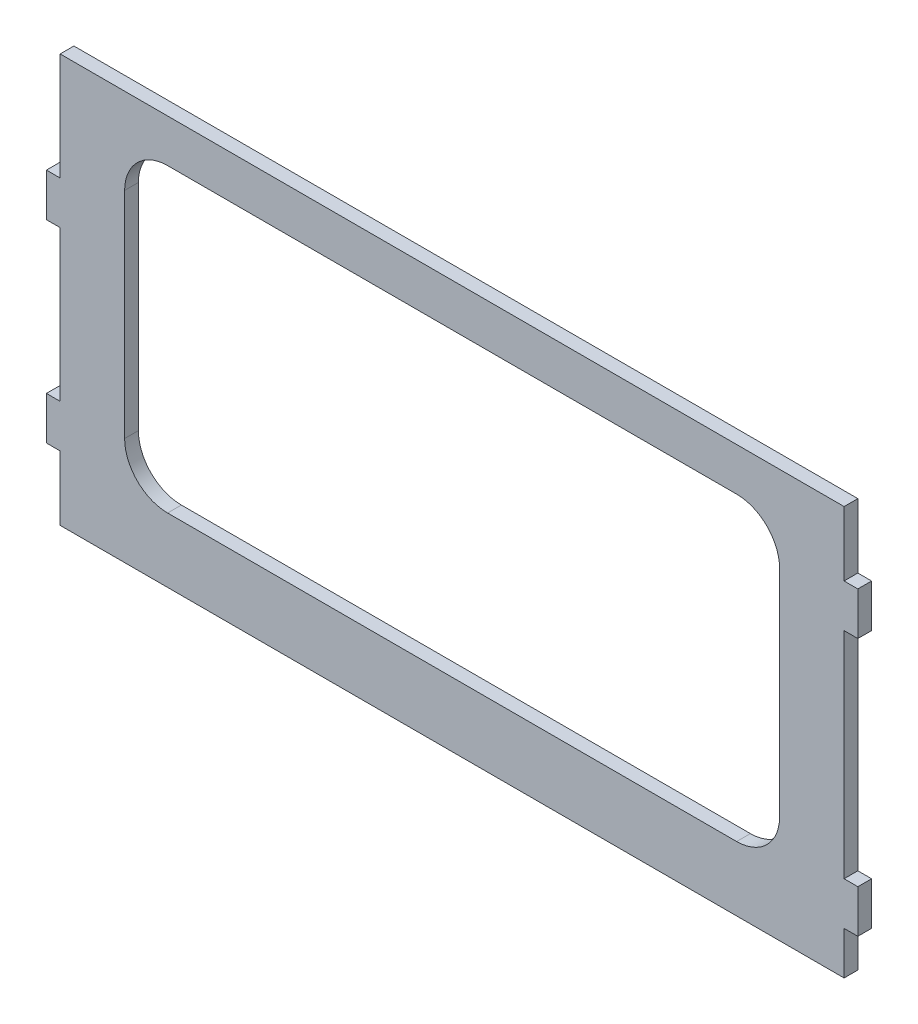
ISO-10303-21;
HEADER;
FILE_DESCRIPTION(('STEP AP214'),'2;1');
FILE_NAME('part.step','',(''),(''),'','','');
FILE_SCHEMA(('AUTOMOTIVE_DESIGN { 1 0 10303 214 1 1 1 1 }'));
ENDSEC;
DATA;
#1=APPLICATION_CONTEXT('core data for automotive mechanical design processes');
#2=APPLICATION_PROTOCOL_DEFINITION('international standard','automotive_design',2000,#1);
#3=PRODUCT_CONTEXT('',#1,'mechanical');
#4=PRODUCT('Part','Part','',(#3));
#5=PRODUCT_RELATED_PRODUCT_CATEGORY('part','',(#4));
#6=PRODUCT_DEFINITION_FORMATION('','',#4);
#7=PRODUCT_DEFINITION_CONTEXT('part definition',#1,'design');
#8=PRODUCT_DEFINITION('design','',#6,#7);
#9=PRODUCT_DEFINITION_SHAPE('','',#8);
#10=(LENGTH_UNIT() NAMED_UNIT(*) SI_UNIT(.MILLI.,.METRE.));
#11=(NAMED_UNIT(*) PLANE_ANGLE_UNIT() SI_UNIT($,.RADIAN.));
#12=(NAMED_UNIT(*) SI_UNIT($,.STERADIAN.) SOLID_ANGLE_UNIT());
#13=UNCERTAINTY_MEASURE_WITH_UNIT(LENGTH_MEASURE(1.E-05),#10,'distance_accuracy_value','');
#14=(GEOMETRIC_REPRESENTATION_CONTEXT(3) GLOBAL_UNCERTAINTY_ASSIGNED_CONTEXT((#13)) GLOBAL_UNIT_ASSIGNED_CONTEXT((#10,
#11,#12)) REPRESENTATION_CONTEXT('',''));
#15=CARTESIAN_POINT('',(0.,0.,0.));
#16=DIRECTION('',(0.,0.,1.));
#17=DIRECTION('',(1.,0.,0.));
#18=AXIS2_PLACEMENT_3D('',#15,#16,#17);
#19=CARTESIAN_POINT('',(125.750548905286,0.,4.064));
#20=DIRECTION('',(-1.,0.,0.));
#21=DIRECTION('',(0.,0.,1.));
#22=AXIS2_PLACEMENT_3D('',#19,#20,#21);
#23=PLANE('',#22);
#24=DIRECTION('',(0.,1.,0.));
#25=VECTOR('',#24,1.);
#26=CARTESIAN_POINT('',(125.750548905286,0.,0.));
#27=LINE('',#26,#25);
#28=CARTESIAN_POINT('',(125.750548905286,-19.0499999999999,0.));
#29=VERTEX_POINT('',#28);
#30=CARTESIAN_POINT('',(125.750548905286,0.,0.));
#31=VERTEX_POINT('',#30);
#32=EDGE_CURVE('E279',#29,#31,#27,.T.);
#33=ORIENTED_EDGE('',*,*,#32,.T.);
#34=DIRECTION('',(0.,0.,-1.));
#35=VECTOR('',#34,1.);
#36=CARTESIAN_POINT('',(125.750548905286,0.,4.064));
#37=LINE('',#36,#35);
#38=CARTESIAN_POINT('',(125.750548905286,0.,4.064));
#39=VERTEX_POINT('',#38);
#40=EDGE_CURVE('E11',#39,#31,#37,.T.);
#41=ORIENTED_EDGE('',*,*,#40,.F.);
#42=DIRECTION('',(0.,1.,0.));
#43=VECTOR('',#42,1.);
#44=CARTESIAN_POINT('',(125.750548905286,0.,4.064));
#45=LINE('',#44,#43);
#46=CARTESIAN_POINT('',(125.750548905286,-19.0499999999999,4.064));
#47=VERTEX_POINT('',#46);
#48=EDGE_CURVE('E291',#47,#39,#45,.T.);
#49=ORIENTED_EDGE('',*,*,#48,.F.);
#50=DIRECTION('',(0.,0.,-1.));
#51=VECTOR('',#50,1.);
#52=CARTESIAN_POINT('',(125.750548905286,-19.0499999999999,4.064));
#53=LINE('',#52,#51);
#54=EDGE_CURVE('E333',#47,#29,#53,.T.);
#55=ORIENTED_EDGE('',*,*,#54,.T.);
#56=EDGE_LOOP('',(#33,#41,#49,#55));
#57=FACE_BOUND('',#56,.T.);
#58=ADVANCED_FACE('F37',(#57),#23,.F.);
#59=CARTESIAN_POINT('',(125.750548905286,0.,4.064));
#60=DIRECTION('',(0.,-1.,0.));
#61=DIRECTION('',(1.,0.,0.));
#62=AXIS2_PLACEMENT_3D('',#59,#60,#61);
#63=PLANE('',#62);
#64=DIRECTION('',(-1.,0.,0.));
#65=VECTOR('',#64,1.);
#66=CARTESIAN_POINT('',(125.750548905286,0.,0.));
#67=LINE('',#66,#65);
#68=CARTESIAN_POINT('',(-105.897451094714,0.,0.));
#69=VERTEX_POINT('',#68);
#70=EDGE_CURVE('E336',#31,#69,#67,.T.);
#71=ORIENTED_EDGE('',*,*,#70,.T.);
#72=DIRECTION('',(0.,0.,-1.));
#73=VECTOR('',#72,1.);
#74=CARTESIAN_POINT('',(-105.897451094714,0.,4.064));
#75=LINE('',#74,#73);
#76=CARTESIAN_POINT('',(-105.897451094714,0.,4.064));
#77=VERTEX_POINT('',#76);
#78=EDGE_CURVE('E44',#77,#69,#75,.T.);
#79=ORIENTED_EDGE('',*,*,#78,.F.);
#80=DIRECTION('',(-1.,0.,0.));
#81=VECTOR('',#80,1.);
#82=CARTESIAN_POINT('',(125.750548905286,0.,4.064));
#83=LINE('',#82,#81);
#84=EDGE_CURVE('E294',#39,#77,#83,.T.);
#85=ORIENTED_EDGE('',*,*,#84,.F.);
#86=ORIENTED_EDGE('',*,*,#40,.T.);
#87=EDGE_LOOP('',(#71,#79,#85,#86));
#88=FACE_BOUND('',#87,.T.);
#89=ADVANCED_FACE('F454',(#88),#63,.F.);
#90=CARTESIAN_POINT('',(-105.897451094714,0.,4.064));
#91=DIRECTION('',(1.,0.,0.));
#92=DIRECTION('',(0.,0.,-1.));
#93=AXIS2_PLACEMENT_3D('',#90,#91,#92);
#94=PLANE('',#93);
#95=DIRECTION('',(0.,-1.,0.));
#96=VECTOR('',#95,1.);
#97=CARTESIAN_POINT('',(-105.897451094714,0.,0.));
#98=LINE('',#97,#96);
#99=CARTESIAN_POINT('',(-105.897451094714,-31.75,0.));
#100=VERTEX_POINT('',#99);
#101=EDGE_CURVE('E338',#69,#100,#98,.T.);
#102=ORIENTED_EDGE('',*,*,#101,.T.);
#103=DIRECTION('',(0.,0.,-1.));
#104=VECTOR('',#103,1.);
#105=CARTESIAN_POINT('',(-105.897451094714,-31.75,4.064));
#106=LINE('',#105,#104);
#107=CARTESIAN_POINT('',(-105.897451094714,-31.75,4.064));
#108=VERTEX_POINT('',#107);
#109=EDGE_CURVE('E426',#108,#100,#106,.T.);
#110=ORIENTED_EDGE('',*,*,#109,.F.);
#111=DIRECTION('',(0.,-1.,0.));
#112=VECTOR('',#111,1.);
#113=CARTESIAN_POINT('',(-105.897451094714,0.,4.064));
#114=LINE('',#113,#112);
#115=EDGE_CURVE('E297',#77,#108,#114,.T.);
#116=ORIENTED_EDGE('',*,*,#115,.F.);
#117=ORIENTED_EDGE('',*,*,#78,.T.);
#118=EDGE_LOOP('',(#102,#110,#116,#117));
#119=FACE_BOUND('',#118,.T.);
#120=ADVANCED_FACE('F433',(#119),#94,.F.);
#121=CARTESIAN_POINT('',(-109.961451094714,-31.75,4.064));
#122=DIRECTION('',(0.,-1.,0.));
#123=DIRECTION('',(1.,0.,0.));
#124=AXIS2_PLACEMENT_3D('',#121,#122,#123);
#125=PLANE('',#124);
#126=DIRECTION('',(-1.,0.,0.));
#127=VECTOR('',#126,1.);
#128=CARTESIAN_POINT('',(-109.961451094714,-31.75,0.));
#129=LINE('',#128,#127);
#130=CARTESIAN_POINT('',(-109.961451094714,-31.75,0.));
#131=VERTEX_POINT('',#130);
#132=EDGE_CURVE('E340',#100,#131,#129,.T.);
#133=ORIENTED_EDGE('',*,*,#132,.T.);
#134=DIRECTION('',(0.,0.,-1.));
#135=VECTOR('',#134,1.);
#136=CARTESIAN_POINT('',(-109.961451094714,-31.75,4.064));
#137=LINE('',#136,#135);
#138=CARTESIAN_POINT('',(-109.961451094714,-31.75,4.064));
#139=VERTEX_POINT('',#138);
#140=EDGE_CURVE('E423',#139,#131,#137,.T.);
#141=ORIENTED_EDGE('',*,*,#140,.F.);
#142=DIRECTION('',(-1.,0.,0.));
#143=VECTOR('',#142,1.);
#144=CARTESIAN_POINT('',(-109.961451094714,-31.75,4.064));
#145=LINE('',#144,#143);
#146=EDGE_CURVE('E299',#108,#139,#145,.T.);
#147=ORIENTED_EDGE('',*,*,#146,.F.);
#148=ORIENTED_EDGE('',*,*,#109,.T.);
#149=EDGE_LOOP('',(#133,#141,#147,#148));
#150=FACE_BOUND('',#149,.T.);
#151=ADVANCED_FACE('F442',(#150),#125,.F.);
#152=CARTESIAN_POINT('',(-109.961451094714,-31.75,4.064));
#153=DIRECTION('',(1.,0.,0.));
#154=DIRECTION('',(0.,0.,-1.));
#155=AXIS2_PLACEMENT_3D('',#152,#153,#154);
#156=PLANE('',#155);
#157=DIRECTION('',(0.,-1.,0.));
#158=VECTOR('',#157,1.);
#159=CARTESIAN_POINT('',(-109.961451094714,-31.75,0.));
#160=LINE('',#159,#158);
#161=CARTESIAN_POINT('',(-109.961451094714,-44.45,0.));
#162=VERTEX_POINT('',#161);
#163=EDGE_CURVE('E342',#131,#162,#160,.T.);
#164=ORIENTED_EDGE('',*,*,#163,.T.);
#165=DIRECTION('',(0.,0.,-1.));
#166=VECTOR('',#165,1.);
#167=CARTESIAN_POINT('',(-109.961451094714,-44.45,4.064));
#168=LINE('',#167,#166);
#169=CARTESIAN_POINT('',(-109.961451094714,-44.45,4.064));
#170=VERTEX_POINT('',#169);
#171=EDGE_CURVE('E420',#170,#162,#168,.T.);
#172=ORIENTED_EDGE('',*,*,#171,.F.);
#173=DIRECTION('',(0.,-1.,0.));
#174=VECTOR('',#173,1.);
#175=CARTESIAN_POINT('',(-109.961451094714,-31.75,4.064));
#176=LINE('',#175,#174);
#177=EDGE_CURVE('E301',#139,#170,#176,.T.);
#178=ORIENTED_EDGE('',*,*,#177,.F.);
#179=ORIENTED_EDGE('',*,*,#140,.T.);
#180=EDGE_LOOP('',(#164,#172,#178,#179));
#181=FACE_BOUND('',#180,.T.);
#182=ADVANCED_FACE('F446',(#181),#156,.F.);
#183=CARTESIAN_POINT('',(-109.961451094714,-44.45,4.064));
#184=DIRECTION('',(0.,1.,0.));
#185=DIRECTION('',(0.,0.,1.));
#186=AXIS2_PLACEMENT_3D('',#183,#184,#185);
#187=PLANE('',#186);
#188=DIRECTION('',(1.,0.,0.));
#189=VECTOR('',#188,1.);
#190=CARTESIAN_POINT('',(-109.961451094714,-44.45,0.));
#191=LINE('',#190,#189);
#192=CARTESIAN_POINT('',(-105.897451094714,-44.45,0.));
#193=VERTEX_POINT('',#192);
#194=EDGE_CURVE('E344',#162,#193,#191,.T.);
#195=ORIENTED_EDGE('',*,*,#194,.T.);
#196=DIRECTION('',(0.,0.,-1.));
#197=VECTOR('',#196,1.);
#198=CARTESIAN_POINT('',(-105.897451094714,-44.45,4.064));
#199=LINE('',#198,#197);
#200=CARTESIAN_POINT('',(-105.897451094714,-44.45,4.064));
#201=VERTEX_POINT('',#200);
#202=EDGE_CURVE('E417',#201,#193,#199,.T.);
#203=ORIENTED_EDGE('',*,*,#202,.F.);
#204=DIRECTION('',(1.,0.,0.));
#205=VECTOR('',#204,1.);
#206=CARTESIAN_POINT('',(-109.961451094714,-44.45,4.064));
#207=LINE('',#206,#205);
#208=EDGE_CURVE('E303',#170,#201,#207,.T.);
#209=ORIENTED_EDGE('',*,*,#208,.F.);
#210=ORIENTED_EDGE('',*,*,#171,.T.);
#211=EDGE_LOOP('',(#195,#203,#209,#210));
#212=FACE_BOUND('',#211,.T.);
#213=ADVANCED_FACE('F527',(#212),#187,.F.);
#214=CARTESIAN_POINT('',(-105.897451094714,-44.45,4.064));
#215=DIRECTION('',(1.,0.,0.));
#216=DIRECTION('',(0.,0.,-1.));
#217=AXIS2_PLACEMENT_3D('',#214,#215,#216);
#218=PLANE('',#217);
#219=DIRECTION('',(0.,-1.,0.));
#220=VECTOR('',#219,1.);
#221=CARTESIAN_POINT('',(-105.897451094714,-44.45,0.));
#222=LINE('',#221,#220);
#223=CARTESIAN_POINT('',(-105.897451094714,-88.9,0.));
#224=VERTEX_POINT('',#223);
#225=EDGE_CURVE('E346',#193,#224,#222,.T.);
#226=ORIENTED_EDGE('',*,*,#225,.T.);
#227=DIRECTION('',(0.,0.,-1.));
#228=VECTOR('',#227,1.);
#229=CARTESIAN_POINT('',(-105.897451094714,-88.9,4.064));
#230=LINE('',#229,#228);
#231=CARTESIAN_POINT('',(-105.897451094714,-88.9,4.064));
#232=VERTEX_POINT('',#231);
#233=EDGE_CURVE('E414',#232,#224,#230,.T.);
#234=ORIENTED_EDGE('',*,*,#233,.F.);
#235=DIRECTION('',(0.,-1.,0.));
#236=VECTOR('',#235,1.);
#237=CARTESIAN_POINT('',(-105.897451094714,-44.45,4.064));
#238=LINE('',#237,#236);
#239=EDGE_CURVE('E305',#201,#232,#238,.T.);
#240=ORIENTED_EDGE('',*,*,#239,.F.);
#241=ORIENTED_EDGE('',*,*,#202,.T.);
#242=EDGE_LOOP('',(#226,#234,#240,#241));
#243=FACE_BOUND('',#242,.T.);
#244=ADVANCED_FACE('F525',(#243),#218,.F.);
#245=CARTESIAN_POINT('',(-109.961451094714,-88.9,4.064));
#246=DIRECTION('',(0.,-1.,0.));
#247=DIRECTION('',(0.,0.,-1.));
#248=AXIS2_PLACEMENT_3D('',#245,#246,#247);
#249=PLANE('',#248);
#250=DIRECTION('',(-1.,0.,0.));
#251=VECTOR('',#250,1.);
#252=CARTESIAN_POINT('',(-109.961451094714,-88.9,0.));
#253=LINE('',#252,#251);
#254=CARTESIAN_POINT('',(-109.961451094714,-88.9,0.));
#255=VERTEX_POINT('',#254);
#256=EDGE_CURVE('E348',#224,#255,#253,.T.);
#257=ORIENTED_EDGE('',*,*,#256,.T.);
#258=DIRECTION('',(0.,0.,-1.));
#259=VECTOR('',#258,1.);
#260=CARTESIAN_POINT('',(-109.961451094714,-88.9,4.064));
#261=LINE('',#260,#259);
#262=CARTESIAN_POINT('',(-109.961451094714,-88.9,4.064));
#263=VERTEX_POINT('',#262);
#264=EDGE_CURVE('E411',#263,#255,#261,.T.);
#265=ORIENTED_EDGE('',*,*,#264,.F.);
#266=DIRECTION('',(-1.,0.,0.));
#267=VECTOR('',#266,1.);
#268=CARTESIAN_POINT('',(-109.961451094714,-88.9,4.064));
#269=LINE('',#268,#267);
#270=EDGE_CURVE('E307',#232,#263,#269,.T.);
#271=ORIENTED_EDGE('',*,*,#270,.F.);
#272=ORIENTED_EDGE('',*,*,#233,.T.);
#273=EDGE_LOOP('',(#257,#265,#271,#272));
#274=FACE_BOUND('',#273,.T.);
#275=ADVANCED_FACE('F520',(#274),#249,.F.);
#276=CARTESIAN_POINT('',(-109.961451094714,-88.9,4.064));
#277=DIRECTION('',(1.,0.,0.));
#278=DIRECTION('',(0.,0.,-1.));
#279=AXIS2_PLACEMENT_3D('',#276,#277,#278);
#280=PLANE('',#279);
#281=DIRECTION('',(0.,-1.,0.));
#282=VECTOR('',#281,1.);
#283=CARTESIAN_POINT('',(-109.961451094714,-88.9,0.));
#284=LINE('',#283,#282);
#285=CARTESIAN_POINT('',(-109.961451094714,-101.6,0.));
#286=VERTEX_POINT('',#285);
#287=EDGE_CURVE('E350',#255,#286,#284,.T.);
#288=ORIENTED_EDGE('',*,*,#287,.T.);
#289=DIRECTION('',(0.,0.,-1.));
#290=VECTOR('',#289,1.);
#291=CARTESIAN_POINT('',(-109.961451094714,-101.6,4.064));
#292=LINE('',#291,#290);
#293=CARTESIAN_POINT('',(-109.961451094714,-101.6,4.064));
#294=VERTEX_POINT('',#293);
#295=EDGE_CURVE('E408',#294,#286,#292,.T.);
#296=ORIENTED_EDGE('',*,*,#295,.F.);
#297=DIRECTION('',(0.,-1.,0.));
#298=VECTOR('',#297,1.);
#299=CARTESIAN_POINT('',(-109.961451094714,-88.9,4.064));
#300=LINE('',#299,#298);
#301=EDGE_CURVE('E309',#263,#294,#300,.T.);
#302=ORIENTED_EDGE('',*,*,#301,.F.);
#303=ORIENTED_EDGE('',*,*,#264,.T.);
#304=EDGE_LOOP('',(#288,#296,#302,#303));
#305=FACE_BOUND('',#304,.T.);
#306=ADVANCED_FACE('F515',(#305),#280,.F.);
#307=CARTESIAN_POINT('',(-109.961451094714,-101.6,4.064));
#308=DIRECTION('',(0.,1.,0.));
#309=DIRECTION('',(0.,0.,1.));
#310=AXIS2_PLACEMENT_3D('',#307,#308,#309);
#311=PLANE('',#310);
#312=DIRECTION('',(1.,0.,0.));
#313=VECTOR('',#312,1.);
#314=CARTESIAN_POINT('',(-109.961451094714,-101.6,0.));
#315=LINE('',#314,#313);
#316=CARTESIAN_POINT('',(-105.897451094714,-101.6,0.));
#317=VERTEX_POINT('',#316);
#318=EDGE_CURVE('E352',#286,#317,#315,.T.);
#319=ORIENTED_EDGE('',*,*,#318,.T.);
#320=DIRECTION('',(0.,0.,-1.));
#321=VECTOR('',#320,1.);
#322=CARTESIAN_POINT('',(-105.897451094714,-101.6,4.064));
#323=LINE('',#322,#321);
#324=CARTESIAN_POINT('',(-105.897451094714,-101.6,4.064));
#325=VERTEX_POINT('',#324);
#326=EDGE_CURVE('E405',#325,#317,#323,.T.);
#327=ORIENTED_EDGE('',*,*,#326,.F.);
#328=DIRECTION('',(1.,0.,0.));
#329=VECTOR('',#328,1.);
#330=CARTESIAN_POINT('',(-109.961451094714,-101.6,4.064));
#331=LINE('',#330,#329);
#332=EDGE_CURVE('E311',#294,#325,#331,.T.);
#333=ORIENTED_EDGE('',*,*,#332,.F.);
#334=ORIENTED_EDGE('',*,*,#295,.T.);
#335=EDGE_LOOP('',(#319,#327,#333,#334));
#336=FACE_BOUND('',#335,.T.);
#337=ADVANCED_FACE('F511',(#336),#311,.F.);
#338=CARTESIAN_POINT('',(-105.897451094714,-101.6,4.064));
#339=DIRECTION('',(1.,0.,0.));
#340=DIRECTION('',(0.,0.,-1.));
#341=AXIS2_PLACEMENT_3D('',#338,#339,#340);
#342=PLANE('',#341);
#343=DIRECTION('',(0.,-1.,0.));
#344=VECTOR('',#343,1.);
#345=CARTESIAN_POINT('',(-105.897451094714,-101.6,0.));
#346=LINE('',#345,#344);
#347=CARTESIAN_POINT('',(-105.897451094714,-120.65,0.));
#348=VERTEX_POINT('',#347);
#349=EDGE_CURVE('E354',#317,#348,#346,.T.);
#350=ORIENTED_EDGE('',*,*,#349,.T.);
#351=DIRECTION('',(0.,0.,-1.));
#352=VECTOR('',#351,1.);
#353=CARTESIAN_POINT('',(-105.897451094714,-120.65,4.064));
#354=LINE('',#353,#352);
#355=CARTESIAN_POINT('',(-105.897451094714,-120.65,4.064));
#356=VERTEX_POINT('',#355);
#357=EDGE_CURVE('E402',#356,#348,#354,.T.);
#358=ORIENTED_EDGE('',*,*,#357,.F.);
#359=DIRECTION('',(0.,-1.,0.));
#360=VECTOR('',#359,1.);
#361=CARTESIAN_POINT('',(-105.897451094714,-101.6,4.064));
#362=LINE('',#361,#360);
#363=EDGE_CURVE('E313',#325,#356,#362,.T.);
#364=ORIENTED_EDGE('',*,*,#363,.F.);
#365=ORIENTED_EDGE('',*,*,#326,.T.);
#366=EDGE_LOOP('',(#350,#358,#364,#365));
#367=FACE_BOUND('',#366,.T.);
#368=ADVANCED_FACE('F506',(#367),#342,.F.);
#369=CARTESIAN_POINT('',(125.750548905286,-120.65,4.064));
#370=DIRECTION('',(0.,1.,0.));
#371=DIRECTION('',(0.,0.,1.));
#372=AXIS2_PLACEMENT_3D('',#369,#370,#371);
#373=PLANE('',#372);
#374=DIRECTION('',(1.,0.,0.));
#375=VECTOR('',#374,1.);
#376=CARTESIAN_POINT('',(125.750548905286,-120.65,0.));
#377=LINE('',#376,#375);
#378=CARTESIAN_POINT('',(125.750548905286,-120.65,0.));
#379=VERTEX_POINT('',#378);
#380=EDGE_CURVE('E356',#348,#379,#377,.T.);
#381=ORIENTED_EDGE('',*,*,#380,.T.);
#382=DIRECTION('',(0.,0.,-1.));
#383=VECTOR('',#382,1.);
#384=CARTESIAN_POINT('',(125.750548905286,-120.65,4.064));
#385=LINE('',#384,#383);
#386=CARTESIAN_POINT('',(125.750548905286,-120.65,4.064));
#387=VERTEX_POINT('',#386);
#388=EDGE_CURVE('E398',#387,#379,#385,.T.);
#389=ORIENTED_EDGE('',*,*,#388,.F.);
#390=DIRECTION('',(1.,0.,0.));
#391=VECTOR('',#390,1.);
#392=CARTESIAN_POINT('',(125.750548905286,-120.65,4.064));
#393=LINE('',#392,#391);
#394=EDGE_CURVE('E315',#356,#387,#393,.T.);
#395=ORIENTED_EDGE('',*,*,#394,.F.);
#396=ORIENTED_EDGE('',*,*,#357,.T.);
#397=EDGE_LOOP('',(#381,#389,#395,#396));
#398=FACE_BOUND('',#397,.T.);
#399=ADVANCED_FACE('F500',(#398),#373,.F.);
#400=CARTESIAN_POINT('',(125.750548905286,-107.95,4.064));
#401=DIRECTION('',(-1.,0.,0.));
#402=DIRECTION('',(0.,0.,1.));
#403=AXIS2_PLACEMENT_3D('',#400,#401,#402);
#404=PLANE('',#403);
#405=DIRECTION('',(0.,1.,0.));
#406=VECTOR('',#405,1.);
#407=CARTESIAN_POINT('',(125.750548905286,-107.95,0.));
#408=LINE('',#407,#406);
#409=CARTESIAN_POINT('',(125.750548905286,-107.95,0.));
#410=VERTEX_POINT('',#409);
#411=EDGE_CURVE('E359',#379,#410,#408,.T.);
#412=ORIENTED_EDGE('',*,*,#411,.T.);
#413=DIRECTION('',(0.,0.,-1.));
#414=VECTOR('',#413,1.);
#415=CARTESIAN_POINT('',(125.750548905286,-107.95,4.064));
#416=LINE('',#415,#414);
#417=CARTESIAN_POINT('',(125.750548905286,-107.95,4.064));
#418=VERTEX_POINT('',#417);
#419=EDGE_CURVE('E395',#418,#410,#416,.T.);
#420=ORIENTED_EDGE('',*,*,#419,.F.);
#421=DIRECTION('',(0.,1.,0.));
#422=VECTOR('',#421,1.);
#423=CARTESIAN_POINT('',(125.750548905286,-107.95,4.064));
#424=LINE('',#423,#422);
#425=EDGE_CURVE('E317',#387,#418,#424,.T.);
#426=ORIENTED_EDGE('',*,*,#425,.F.);
#427=ORIENTED_EDGE('',*,*,#388,.T.);
#428=EDGE_LOOP('',(#412,#420,#426,#427));
#429=FACE_BOUND('',#428,.T.);
#430=ADVANCED_FACE('F496',(#429),#404,.F.);
#431=CARTESIAN_POINT('',(129.814548905286,-107.95,4.064));
#432=DIRECTION('',(0.,1.,0.));
#433=DIRECTION('',(0.,0.,1.));
#434=AXIS2_PLACEMENT_3D('',#431,#432,#433);
#435=PLANE('',#434);
#436=DIRECTION('',(1.,0.,0.));
#437=VECTOR('',#436,1.);
#438=CARTESIAN_POINT('',(129.814548905286,-107.95,0.));
#439=LINE('',#438,#437);
#440=CARTESIAN_POINT('',(129.814548905286,-107.95,0.));
#441=VERTEX_POINT('',#440);
#442=EDGE_CURVE('E362',#410,#441,#439,.T.);
#443=ORIENTED_EDGE('',*,*,#442,.T.);
#444=DIRECTION('',(0.,0.,-1.));
#445=VECTOR('',#444,1.);
#446=CARTESIAN_POINT('',(129.814548905286,-107.95,4.064));
#447=LINE('',#446,#445);
#448=CARTESIAN_POINT('',(129.814548905286,-107.95,4.064));
#449=VERTEX_POINT('',#448);
#450=EDGE_CURVE('E392',#449,#441,#447,.T.);
#451=ORIENTED_EDGE('',*,*,#450,.F.);
#452=DIRECTION('',(1.,0.,0.));
#453=VECTOR('',#452,1.);
#454=CARTESIAN_POINT('',(129.814548905286,-107.95,4.064));
#455=LINE('',#454,#453);
#456=EDGE_CURVE('E319',#418,#449,#455,.T.);
#457=ORIENTED_EDGE('',*,*,#456,.F.);
#458=ORIENTED_EDGE('',*,*,#419,.T.);
#459=EDGE_LOOP('',(#443,#451,#457,#458));
#460=FACE_BOUND('',#459,.T.);
#461=ADVANCED_FACE('F491',(#460),#435,.F.);
#462=CARTESIAN_POINT('',(129.814548905286,-107.95,4.064));
#463=DIRECTION('',(-1.,0.,0.));
#464=DIRECTION('',(0.,0.,1.));
#465=AXIS2_PLACEMENT_3D('',#462,#463,#464);
#466=PLANE('',#465);
#467=DIRECTION('',(0.,1.,0.));
#468=VECTOR('',#467,1.);
#469=CARTESIAN_POINT('',(129.814548905286,-107.95,0.));
#470=LINE('',#469,#468);
#471=CARTESIAN_POINT('',(129.814548905286,-95.25,0.));
#472=VERTEX_POINT('',#471);
#473=EDGE_CURVE('E364',#441,#472,#470,.T.);
#474=ORIENTED_EDGE('',*,*,#473,.T.);
#475=DIRECTION('',(0.,0.,-1.));
#476=VECTOR('',#475,1.);
#477=CARTESIAN_POINT('',(129.814548905286,-95.25,4.064));
#478=LINE('',#477,#476);
#479=CARTESIAN_POINT('',(129.814548905286,-95.25,4.064));
#480=VERTEX_POINT('',#479);
#481=EDGE_CURVE('E389',#480,#472,#478,.T.);
#482=ORIENTED_EDGE('',*,*,#481,.F.);
#483=DIRECTION('',(0.,1.,0.));
#484=VECTOR('',#483,1.);
#485=CARTESIAN_POINT('',(129.814548905286,-107.95,4.064));
#486=LINE('',#485,#484);
#487=EDGE_CURVE('E321',#449,#480,#486,.T.);
#488=ORIENTED_EDGE('',*,*,#487,.F.);
#489=ORIENTED_EDGE('',*,*,#450,.T.);
#490=EDGE_LOOP('',(#474,#482,#488,#489));
#491=FACE_BOUND('',#490,.T.);
#492=ADVANCED_FACE('F485',(#491),#466,.F.);
#493=CARTESIAN_POINT('',(129.814548905286,-95.25,4.064));
#494=DIRECTION('',(0.,-1.,0.));
#495=DIRECTION('',(0.,0.,-1.));
#496=AXIS2_PLACEMENT_3D('',#493,#494,#495);
#497=PLANE('',#496);
#498=DIRECTION('',(-1.,0.,0.));
#499=VECTOR('',#498,1.);
#500=CARTESIAN_POINT('',(129.814548905286,-95.25,0.));
#501=LINE('',#500,#499);
#502=CARTESIAN_POINT('',(125.750548905286,-95.25,0.));
#503=VERTEX_POINT('',#502);
#504=EDGE_CURVE('E366',#472,#503,#501,.T.);
#505=ORIENTED_EDGE('',*,*,#504,.T.);
#506=DIRECTION('',(0.,0.,-1.));
#507=VECTOR('',#506,1.);
#508=CARTESIAN_POINT('',(125.750548905286,-95.25,4.064));
#509=LINE('',#508,#507);
#510=CARTESIAN_POINT('',(125.750548905286,-95.25,4.064));
#511=VERTEX_POINT('',#510);
#512=EDGE_CURVE('E386',#511,#503,#509,.T.);
#513=ORIENTED_EDGE('',*,*,#512,.F.);
#514=DIRECTION('',(-1.,0.,0.));
#515=VECTOR('',#514,1.);
#516=CARTESIAN_POINT('',(129.814548905286,-95.25,4.064));
#517=LINE('',#516,#515);
#518=EDGE_CURVE('E323',#480,#511,#517,.T.);
#519=ORIENTED_EDGE('',*,*,#518,.F.);
#520=ORIENTED_EDGE('',*,*,#481,.T.);
#521=EDGE_LOOP('',(#505,#513,#519,#520));
#522=FACE_BOUND('',#521,.T.);
#523=ADVANCED_FACE('F481',(#522),#497,.F.);
#524=CARTESIAN_POINT('',(125.750548905286,-31.75,4.064));
#525=DIRECTION('',(-1.,0.,0.));
#526=DIRECTION('',(0.,0.,1.));
#527=AXIS2_PLACEMENT_3D('',#524,#525,#526);
#528=PLANE('',#527);
#529=DIRECTION('',(0.,1.,0.));
#530=VECTOR('',#529,1.);
#531=CARTESIAN_POINT('',(125.750548905286,-31.75,0.));
#532=LINE('',#531,#530);
#533=CARTESIAN_POINT('',(125.750548905286,-31.75,0.));
#534=VERTEX_POINT('',#533);
#535=EDGE_CURVE('E368',#503,#534,#532,.T.);
#536=ORIENTED_EDGE('',*,*,#535,.T.);
#537=DIRECTION('',(0.,0.,-1.));
#538=VECTOR('',#537,1.);
#539=CARTESIAN_POINT('',(125.750548905286,-31.75,4.064));
#540=LINE('',#539,#538);
#541=CARTESIAN_POINT('',(125.750548905286,-31.75,4.064));
#542=VERTEX_POINT('',#541);
#543=EDGE_CURVE('E383',#542,#534,#540,.T.);
#544=ORIENTED_EDGE('',*,*,#543,.F.);
#545=DIRECTION('',(0.,1.,0.));
#546=VECTOR('',#545,1.);
#547=CARTESIAN_POINT('',(125.750548905286,-31.75,4.064));
#548=LINE('',#547,#546);
#549=EDGE_CURVE('E325',#511,#542,#548,.T.);
#550=ORIENTED_EDGE('',*,*,#549,.F.);
#551=ORIENTED_EDGE('',*,*,#512,.T.);
#552=EDGE_LOOP('',(#536,#544,#550,#551));
#553=FACE_BOUND('',#552,.T.);
#554=ADVANCED_FACE('F476',(#553),#528,.F.);
#555=CARTESIAN_POINT('',(125.750548905286,-31.75,4.064));
#556=DIRECTION('',(0.,1.,0.));
#557=DIRECTION('',(0.,0.,1.));
#558=AXIS2_PLACEMENT_3D('',#555,#556,#557);
#559=PLANE('',#558);
#560=DIRECTION('',(1.,0.,0.));
#561=VECTOR('',#560,1.);
#562=CARTESIAN_POINT('',(125.750548905286,-31.75,0.));
#563=LINE('',#562,#561);
#564=CARTESIAN_POINT('',(129.814548905286,-31.75,0.));
#565=VERTEX_POINT('',#564);
#566=EDGE_CURVE('E370',#534,#565,#563,.T.);
#567=ORIENTED_EDGE('',*,*,#566,.T.);
#568=DIRECTION('',(0.,0.,-1.));
#569=VECTOR('',#568,1.);
#570=CARTESIAN_POINT('',(129.814548905286,-31.75,4.064));
#571=LINE('',#570,#569);
#572=CARTESIAN_POINT('',(129.814548905286,-31.75,4.064));
#573=VERTEX_POINT('',#572);
#574=EDGE_CURVE('E380',#573,#565,#571,.T.);
#575=ORIENTED_EDGE('',*,*,#574,.F.);
#576=DIRECTION('',(1.,0.,0.));
#577=VECTOR('',#576,1.);
#578=CARTESIAN_POINT('',(125.750548905286,-31.75,4.064));
#579=LINE('',#578,#577);
#580=EDGE_CURVE('E327',#542,#573,#579,.T.);
#581=ORIENTED_EDGE('',*,*,#580,.F.);
#582=ORIENTED_EDGE('',*,*,#543,.T.);
#583=EDGE_LOOP('',(#567,#575,#581,#582));
#584=FACE_BOUND('',#583,.T.);
#585=ADVANCED_FACE('F470',(#584),#559,.F.);
#586=CARTESIAN_POINT('',(129.814548905286,-19.0499999999999,4.064));
#587=DIRECTION('',(-1.,0.,0.));
#588=DIRECTION('',(0.,0.,1.));
#589=AXIS2_PLACEMENT_3D('',#586,#587,#588);
#590=PLANE('',#589);
#591=DIRECTION('',(0.,1.,0.));
#592=VECTOR('',#591,1.);
#593=CARTESIAN_POINT('',(129.814548905286,-19.0499999999999,0.));
#594=LINE('',#593,#592);
#595=CARTESIAN_POINT('',(129.814548905286,-19.0499999999999,0.));
#596=VERTEX_POINT('',#595);
#597=EDGE_CURVE('E372',#565,#596,#594,.T.);
#598=ORIENTED_EDGE('',*,*,#597,.T.);
#599=DIRECTION('',(0.,0.,-1.));
#600=VECTOR('',#599,1.);
#601=CARTESIAN_POINT('',(129.814548905286,-19.0499999999999,4.064));
#602=LINE('',#601,#600);
#603=CARTESIAN_POINT('',(129.814548905286,-19.0499999999999,4.064));
#604=VERTEX_POINT('',#603);
#605=EDGE_CURVE('E377',#604,#596,#602,.T.);
#606=ORIENTED_EDGE('',*,*,#605,.F.);
#607=DIRECTION('',(0.,1.,0.));
#608=VECTOR('',#607,1.);
#609=CARTESIAN_POINT('',(129.814548905286,-19.0499999999999,4.064));
#610=LINE('',#609,#608);
#611=EDGE_CURVE('E329',#573,#604,#610,.T.);
#612=ORIENTED_EDGE('',*,*,#611,.F.);
#613=ORIENTED_EDGE('',*,*,#574,.T.);
#614=EDGE_LOOP('',(#598,#606,#612,#613));
#615=FACE_BOUND('',#614,.T.);
#616=ADVANCED_FACE('F466',(#615),#590,.F.);
#617=CARTESIAN_POINT('',(125.750548905286,-19.0499999999999,4.064));
#618=DIRECTION('',(0.,-1.,0.));
#619=DIRECTION('',(0.,0.,-1.));
#620=AXIS2_PLACEMENT_3D('',#617,#618,#619);
#621=PLANE('',#620);
#622=DIRECTION('',(-1.,0.,0.));
#623=VECTOR('',#622,1.);
#624=CARTESIAN_POINT('',(125.750548905286,-19.0499999999999,0.));
#625=LINE('',#624,#623);
#626=EDGE_CURVE('E295',#596,#29,#625,.T.);
#627=ORIENTED_EDGE('',*,*,#626,.T.);
#628=ORIENTED_EDGE('',*,*,#54,.F.);
#629=DIRECTION('',(-1.,0.,0.));
#630=VECTOR('',#629,1.);
#631=CARTESIAN_POINT('',(125.750548905286,-19.0499999999999,4.064));
#632=LINE('',#631,#630);
#633=EDGE_CURVE('E331',#604,#47,#632,.T.);
#634=ORIENTED_EDGE('',*,*,#633,.F.);
#635=ORIENTED_EDGE('',*,*,#605,.T.);
#636=EDGE_LOOP('',(#627,#628,#634,#635));
#637=FACE_BOUND('',#636,.T.);
#638=ADVANCED_FACE('F461',(#637),#621,.F.);
#639=CARTESIAN_POINT('',(0.,0.,4.064));
#640=DIRECTION('',(0.,0.,1.));
#641=DIRECTION('',(1.,0.,0.));
#642=AXIS2_PLACEMENT_3D('',#639,#640,#641);
#643=PLANE('',#642);
#644=CARTESIAN_POINT('',(94.0005489052861,-88.9,4.064));
#645=DIRECTION('',(0.,0.,1.));
#646=DIRECTION('',(1.,0.,0.));
#647=AXIS2_PLACEMENT_3D('',#644,#645,#646);
#648=CIRCLE('',#647,12.7);
#649=CARTESIAN_POINT('',(94.0005489052861,-101.6,4.064));
#650=VERTEX_POINT('',#649);
#651=CARTESIAN_POINT('',(106.700548905286,-88.8999999999999,4.064));
#652=VERTEX_POINT('',#651);
#653=EDGE_CURVE('E51',#650,#652,#648,.T.);
#654=ORIENTED_EDGE('',*,*,#653,.F.);
#655=DIRECTION('',(1.,0.,0.));
#656=VECTOR('',#655,1.);
#657=CARTESIAN_POINT('',(-74.1474510947138,-101.6,4.064));
#658=LINE('',#657,#656);
#659=CARTESIAN_POINT('',(-74.1474510947138,-101.6,4.064));
#660=VERTEX_POINT('',#659);
#661=EDGE_CURVE('E241',#660,#650,#658,.T.);
#662=ORIENTED_EDGE('',*,*,#661,.F.);
#663=CARTESIAN_POINT('',(-74.1474510947138,-88.9,4.064));
#664=DIRECTION('',(0.,0.,1.));
#665=DIRECTION('',(1.,0.,0.));
#666=AXIS2_PLACEMENT_3D('',#663,#664,#665);
#667=CIRCLE('',#666,12.7);
#668=CARTESIAN_POINT('',(-86.8474510947138,-88.9,4.064));
#669=VERTEX_POINT('',#668);
#670=EDGE_CURVE('E244',#669,#660,#667,.T.);
#671=ORIENTED_EDGE('',*,*,#670,.F.);
#672=DIRECTION('',(0.,-1.,0.));
#673=VECTOR('',#672,1.);
#674=CARTESIAN_POINT('',(-86.8474510947138,-25.3999999999999,4.064));
#675=LINE('',#674,#673);
#676=CARTESIAN_POINT('',(-86.8474510947138,-25.3999999999999,4.064));
#677=VERTEX_POINT('',#676);
#678=EDGE_CURVE('E272',#677,#669,#675,.T.);
#679=ORIENTED_EDGE('',*,*,#678,.F.);
#680=CARTESIAN_POINT('',(-74.1474510947138,-25.3999999999999,4.064));
#681=DIRECTION('',(0.,0.,1.));
#682=DIRECTION('',(1.,0.,0.));
#683=AXIS2_PLACEMENT_3D('',#680,#681,#682);
#684=CIRCLE('',#683,12.7);
#685=CARTESIAN_POINT('',(-74.1474510947138,-12.7,4.064));
#686=VERTEX_POINT('',#685);
#687=EDGE_CURVE('E269',#686,#677,#684,.T.);
#688=ORIENTED_EDGE('',*,*,#687,.F.);
#689=DIRECTION('',(-1.,0.,0.));
#690=VECTOR('',#689,1.);
#691=CARTESIAN_POINT('',(-74.1474510947138,-12.6999999999999,4.064));
#692=LINE('',#691,#690);
#693=CARTESIAN_POINT('',(94.0005489052861,-12.6999999999999,4.064));
#694=VERTEX_POINT('',#693);
#695=EDGE_CURVE('E266',#694,#686,#692,.T.);
#696=ORIENTED_EDGE('',*,*,#695,.F.);
#697=CARTESIAN_POINT('',(94.0005489052862,-25.3999999999999,4.064));
#698=DIRECTION('',(0.,0.,1.));
#699=DIRECTION('',(-1.,0.,0.));
#700=AXIS2_PLACEMENT_3D('',#697,#698,#699);
#701=CIRCLE('',#700,12.7);
#702=CARTESIAN_POINT('',(106.700548905286,-25.4,4.064));
#703=VERTEX_POINT('',#702);
#704=EDGE_CURVE('E263',#703,#694,#701,.T.);
#705=ORIENTED_EDGE('',*,*,#704,.F.);
#706=DIRECTION('',(0.,1.,0.));
#707=VECTOR('',#706,1.);
#708=CARTESIAN_POINT('',(106.700548905286,-25.4,4.064));
#709=LINE('',#708,#707);
#710=EDGE_CURVE('E261',#652,#703,#709,.T.);
#711=ORIENTED_EDGE('',*,*,#710,.F.);
#712=EDGE_LOOP('',(#654,#662,#671,#679,#688,#696,#705,#711));
#713=FACE_BOUND('',#712,.T.);
#714=ORIENTED_EDGE('',*,*,#48,.T.);
#715=ORIENTED_EDGE('',*,*,#84,.T.);
#716=ORIENTED_EDGE('',*,*,#115,.T.);
#717=ORIENTED_EDGE('',*,*,#146,.T.);
#718=ORIENTED_EDGE('',*,*,#177,.T.);
#719=ORIENTED_EDGE('',*,*,#208,.T.);
#720=ORIENTED_EDGE('',*,*,#239,.T.);
#721=ORIENTED_EDGE('',*,*,#270,.T.);
#722=ORIENTED_EDGE('',*,*,#301,.T.);
#723=ORIENTED_EDGE('',*,*,#332,.T.);
#724=ORIENTED_EDGE('',*,*,#363,.T.);
#725=ORIENTED_EDGE('',*,*,#394,.T.);
#726=ORIENTED_EDGE('',*,*,#425,.T.);
#727=ORIENTED_EDGE('',*,*,#456,.T.);
#728=ORIENTED_EDGE('',*,*,#487,.T.);
#729=ORIENTED_EDGE('',*,*,#518,.T.);
#730=ORIENTED_EDGE('',*,*,#549,.T.);
#731=ORIENTED_EDGE('',*,*,#580,.T.);
#732=ORIENTED_EDGE('',*,*,#611,.T.);
#733=ORIENTED_EDGE('',*,*,#633,.T.);
#734=EDGE_LOOP('',(#714,#715,#716,#717,#718,#719,#720,#721,#722,#723,#724,#725,#726,#727,#728,
#729,#730,#731,#732,#733));
#735=FACE_BOUND('',#734,.T.);
#736=ADVANCED_FACE('F450',(#713,#735),#643,.T.);
#737=CARTESIAN_POINT('',(0.,0.,0.));
#738=DIRECTION('',(0.,0.,1.));
#739=DIRECTION('',(1.,0.,0.));
#740=AXIS2_PLACEMENT_3D('',#737,#738,#739);
#741=PLANE('',#740);
#742=DIRECTION('',(1.,0.,0.));
#743=VECTOR('',#742,1.);
#744=CARTESIAN_POINT('',(-74.1474510947138,-101.6,0.));
#745=LINE('',#744,#743);
#746=CARTESIAN_POINT('',(-74.1474510947138,-101.6,0.));
#747=VERTEX_POINT('',#746);
#748=CARTESIAN_POINT('',(94.0005489052861,-101.6,0.));
#749=VERTEX_POINT('',#748);
#750=EDGE_CURVE('E230',#747,#749,#745,.T.);
#751=ORIENTED_EDGE('',*,*,#750,.T.);
#752=CARTESIAN_POINT('',(94.0005489052861,-88.9,0.));
#753=DIRECTION('',(0.,0.,1.));
#754=DIRECTION('',(1.,0.,0.));
#755=AXIS2_PLACEMENT_3D('',#752,#753,#754);
#756=CIRCLE('',#755,12.7);
#757=CARTESIAN_POINT('',(106.700548905286,-88.8999999999999,0.));
#758=VERTEX_POINT('',#757);
#759=EDGE_CURVE('E224',#749,#758,#756,.T.);
#760=ORIENTED_EDGE('',*,*,#759,.T.);
#761=DIRECTION('',(0.,1.,0.));
#762=VECTOR('',#761,1.);
#763=CARTESIAN_POINT('',(106.700548905286,-25.4,0.));
#764=LINE('',#763,#762);
#765=CARTESIAN_POINT('',(106.700548905286,-25.4,0.));
#766=VERTEX_POINT('',#765);
#767=EDGE_CURVE('E233',#758,#766,#764,.T.);
#768=ORIENTED_EDGE('',*,*,#767,.T.);
#769=CARTESIAN_POINT('',(94.0005489052862,-25.3999999999999,0.));
#770=DIRECTION('',(0.,0.,1.));
#771=DIRECTION('',(-1.,0.,0.));
#772=AXIS2_PLACEMENT_3D('',#769,#770,#771);
#773=CIRCLE('',#772,12.7);
#774=CARTESIAN_POINT('',(94.0005489052861,-12.6999999999999,0.));
#775=VERTEX_POINT('',#774);
#776=EDGE_CURVE('E59',#766,#775,#773,.T.);
#777=ORIENTED_EDGE('',*,*,#776,.T.);
#778=DIRECTION('',(-1.,0.,0.));
#779=VECTOR('',#778,1.);
#780=CARTESIAN_POINT('',(-74.1474510947138,-12.6999999999999,0.));
#781=LINE('',#780,#779);
#782=CARTESIAN_POINT('',(-74.1474510947138,-12.7,0.));
#783=VERTEX_POINT('',#782);
#784=EDGE_CURVE('E248',#775,#783,#781,.T.);
#785=ORIENTED_EDGE('',*,*,#784,.T.);
#786=CARTESIAN_POINT('',(-74.1474510947138,-25.3999999999999,0.));
#787=DIRECTION('',(0.,0.,1.));
#788=DIRECTION('',(1.,0.,0.));
#789=AXIS2_PLACEMENT_3D('',#786,#787,#788);
#790=CIRCLE('',#789,12.7);
#791=CARTESIAN_POINT('',(-86.8474510947138,-25.3999999999999,0.));
#792=VERTEX_POINT('',#791);
#793=EDGE_CURVE('E251',#783,#792,#790,.T.);
#794=ORIENTED_EDGE('',*,*,#793,.T.);
#795=DIRECTION('',(0.,-1.,0.));
#796=VECTOR('',#795,1.);
#797=CARTESIAN_POINT('',(-86.8474510947138,-25.3999999999999,0.));
#798=LINE('',#797,#796);
#799=CARTESIAN_POINT('',(-86.8474510947138,-88.9,0.));
#800=VERTEX_POINT('',#799);
#801=EDGE_CURVE('E254',#792,#800,#798,.T.);
#802=ORIENTED_EDGE('',*,*,#801,.T.);
#803=CARTESIAN_POINT('',(-74.1474510947138,-88.9,0.));
#804=DIRECTION('',(0.,0.,1.));
#805=DIRECTION('',(1.,0.,0.));
#806=AXIS2_PLACEMENT_3D('',#803,#804,#805);
#807=CIRCLE('',#806,12.7);
#808=EDGE_CURVE('E257',#800,#747,#807,.T.);
#809=ORIENTED_EDGE('',*,*,#808,.T.);
#810=EDGE_LOOP('',(#751,#760,#768,#777,#785,#794,#802,#809));
#811=FACE_BOUND('',#810,.T.);
#812=ORIENTED_EDGE('',*,*,#32,.F.);
#813=ORIENTED_EDGE('',*,*,#626,.F.);
#814=ORIENTED_EDGE('',*,*,#597,.F.);
#815=ORIENTED_EDGE('',*,*,#566,.F.);
#816=ORIENTED_EDGE('',*,*,#535,.F.);
#817=ORIENTED_EDGE('',*,*,#504,.F.);
#818=ORIENTED_EDGE('',*,*,#473,.F.);
#819=ORIENTED_EDGE('',*,*,#442,.F.);
#820=ORIENTED_EDGE('',*,*,#411,.F.);
#821=ORIENTED_EDGE('',*,*,#380,.F.);
#822=ORIENTED_EDGE('',*,*,#349,.F.);
#823=ORIENTED_EDGE('',*,*,#318,.F.);
#824=ORIENTED_EDGE('',*,*,#287,.F.);
#825=ORIENTED_EDGE('',*,*,#256,.F.);
#826=ORIENTED_EDGE('',*,*,#225,.F.);
#827=ORIENTED_EDGE('',*,*,#194,.F.);
#828=ORIENTED_EDGE('',*,*,#163,.F.);
#829=ORIENTED_EDGE('',*,*,#132,.F.);
#830=ORIENTED_EDGE('',*,*,#101,.F.);
#831=ORIENTED_EDGE('',*,*,#70,.F.);
#832=EDGE_LOOP('',(#812,#813,#814,#815,#816,#817,#818,#819,#820,#821,#822,#823,#824,#825,#826,
#827,#828,#829,#830,#831));
#833=FACE_BOUND('',#832,.T.);
#834=ADVANCED_FACE('F237',(#811,#833),#741,.F.);
#835=CARTESIAN_POINT('',(94.0005489052861,-88.9,0.));
#836=DIRECTION('',(0.,0.,1.));
#837=DIRECTION('',(1.,0.,0.));
#838=AXIS2_PLACEMENT_3D('',#835,#836,#837);
#839=CYLINDRICAL_SURFACE('',#838,12.7);
#840=ORIENTED_EDGE('',*,*,#653,.T.);
#841=DIRECTION('',(0.,0.,1.));
#842=VECTOR('',#841,1.);
#843=CARTESIAN_POINT('',(106.700548905286,-88.8999999999999,0.));
#844=LINE('',#843,#842);
#845=EDGE_CURVE('E220',#758,#652,#844,.T.);
#846=ORIENTED_EDGE('',*,*,#845,.F.);
#847=ORIENTED_EDGE('',*,*,#759,.F.);
#848=DIRECTION('',(0.,0.,1.));
#849=VECTOR('',#848,1.);
#850=CARTESIAN_POINT('',(94.0005489052861,-101.6,0.));
#851=LINE('',#850,#849);
#852=EDGE_CURVE('E277',#749,#650,#851,.T.);
#853=ORIENTED_EDGE('',*,*,#852,.T.);
#854=EDGE_LOOP('',(#840,#846,#847,#853));
#855=FACE_BOUND('',#854,.T.);
#856=ADVANCED_FACE('F222',(#855),#839,.F.);
#857=CARTESIAN_POINT('',(-74.1474510947138,-101.6,0.));
#858=DIRECTION('',(0.,-1.,0.));
#859=DIRECTION('',(0.,0.,-1.));
#860=AXIS2_PLACEMENT_3D('',#857,#858,#859);
#861=PLANE('',#860);
#862=ORIENTED_EDGE('',*,*,#661,.T.);
#863=ORIENTED_EDGE('',*,*,#852,.F.);
#864=ORIENTED_EDGE('',*,*,#750,.F.);
#865=DIRECTION('',(0.,0.,1.));
#866=VECTOR('',#865,1.);
#867=CARTESIAN_POINT('',(-74.1474510947138,-101.6,0.));
#868=LINE('',#867,#866);
#869=EDGE_CURVE('E280',#747,#660,#868,.T.);
#870=ORIENTED_EDGE('',*,*,#869,.T.);
#871=EDGE_LOOP('',(#862,#863,#864,#870));
#872=FACE_BOUND('',#871,.T.);
#873=ADVANCED_FACE('F694',(#872),#861,.F.);
#874=CARTESIAN_POINT('',(-74.1474510947138,-88.9,0.));
#875=DIRECTION('',(0.,0.,1.));
#876=DIRECTION('',(1.,0.,0.));
#877=AXIS2_PLACEMENT_3D('',#874,#875,#876);
#878=CYLINDRICAL_SURFACE('',#877,12.7);
#879=ORIENTED_EDGE('',*,*,#670,.T.);
#880=ORIENTED_EDGE('',*,*,#869,.F.);
#881=ORIENTED_EDGE('',*,*,#808,.F.);
#882=DIRECTION('',(0.,0.,1.));
#883=VECTOR('',#882,1.);
#884=CARTESIAN_POINT('',(-86.8474510947138,-88.9,0.));
#885=LINE('',#884,#883);
#886=EDGE_CURVE('E282',#800,#669,#885,.T.);
#887=ORIENTED_EDGE('',*,*,#886,.T.);
#888=EDGE_LOOP('',(#879,#880,#881,#887));
#889=FACE_BOUND('',#888,.T.);
#890=ADVANCED_FACE('F703',(#889),#878,.F.);
#891=CARTESIAN_POINT('',(-86.8474510947138,-25.3999999999999,0.));
#892=DIRECTION('',(-1.,0.,0.));
#893=DIRECTION('',(0.,-1.,0.));
#894=AXIS2_PLACEMENT_3D('',#891,#892,#893);
#895=PLANE('',#894);
#896=ORIENTED_EDGE('',*,*,#678,.T.);
#897=ORIENTED_EDGE('',*,*,#886,.F.);
#898=ORIENTED_EDGE('',*,*,#801,.F.);
#899=DIRECTION('',(0.,0.,1.));
#900=VECTOR('',#899,1.);
#901=CARTESIAN_POINT('',(-86.8474510947138,-25.3999999999999,0.));
#902=LINE('',#901,#900);
#903=EDGE_CURVE('E284',#792,#677,#902,.T.);
#904=ORIENTED_EDGE('',*,*,#903,.T.);
#905=EDGE_LOOP('',(#896,#897,#898,#904));
#906=FACE_BOUND('',#905,.T.);
#907=ADVANCED_FACE('F713',(#906),#895,.F.);
#908=CARTESIAN_POINT('',(-74.1474510947138,-25.3999999999999,0.));
#909=DIRECTION('',(0.,0.,1.));
#910=DIRECTION('',(1.,0.,0.));
#911=AXIS2_PLACEMENT_3D('',#908,#909,#910);
#912=CYLINDRICAL_SURFACE('',#911,12.7);
#913=ORIENTED_EDGE('',*,*,#687,.T.);
#914=ORIENTED_EDGE('',*,*,#903,.F.);
#915=ORIENTED_EDGE('',*,*,#793,.F.);
#916=DIRECTION('',(0.,0.,1.));
#917=VECTOR('',#916,1.);
#918=CARTESIAN_POINT('',(-74.1474510947138,-12.7,0.));
#919=LINE('',#918,#917);
#920=EDGE_CURVE('E286',#783,#686,#919,.T.);
#921=ORIENTED_EDGE('',*,*,#920,.T.);
#922=EDGE_LOOP('',(#913,#914,#915,#921));
#923=FACE_BOUND('',#922,.T.);
#924=ADVANCED_FACE('F723',(#923),#912,.F.);
#925=CARTESIAN_POINT('',(-74.1474510947138,-12.6999999999999,0.));
#926=DIRECTION('',(0.,1.,0.));
#927=DIRECTION('',(0.,0.,1.));
#928=AXIS2_PLACEMENT_3D('',#925,#926,#927);
#929=PLANE('',#928);
#930=ORIENTED_EDGE('',*,*,#695,.T.);
#931=ORIENTED_EDGE('',*,*,#920,.F.);
#932=ORIENTED_EDGE('',*,*,#784,.F.);
#933=DIRECTION('',(0.,0.,1.));
#934=VECTOR('',#933,1.);
#935=CARTESIAN_POINT('',(94.0005489052861,-12.6999999999999,0.));
#936=LINE('',#935,#934);
#937=EDGE_CURVE('E288',#775,#694,#936,.T.);
#938=ORIENTED_EDGE('',*,*,#937,.T.);
#939=EDGE_LOOP('',(#930,#931,#932,#938));
#940=FACE_BOUND('',#939,.T.);
#941=ADVANCED_FACE('F733',(#940),#929,.F.);
#942=CARTESIAN_POINT('',(94.0005489052862,-25.3999999999999,0.));
#943=DIRECTION('',(0.,0.,1.));
#944=DIRECTION('',(1.,0.,0.));
#945=AXIS2_PLACEMENT_3D('',#942,#943,#944);
#946=CYLINDRICAL_SURFACE('',#945,12.7);
#947=ORIENTED_EDGE('',*,*,#704,.T.);
#948=ORIENTED_EDGE('',*,*,#937,.F.);
#949=ORIENTED_EDGE('',*,*,#776,.F.);
#950=DIRECTION('',(0.,0.,1.));
#951=VECTOR('',#950,1.);
#952=CARTESIAN_POINT('',(106.700548905286,-25.4,0.));
#953=LINE('',#952,#951);
#954=EDGE_CURVE('E229',#766,#703,#953,.T.);
#955=ORIENTED_EDGE('',*,*,#954,.T.);
#956=EDGE_LOOP('',(#947,#948,#949,#955));
#957=FACE_BOUND('',#956,.T.);
#958=ADVANCED_FACE('F743',(#957),#946,.F.);
#959=CARTESIAN_POINT('',(106.700548905286,-25.4,0.));
#960=DIRECTION('',(1.,0.,0.));
#961=DIRECTION('',(0.,1.,0.));
#962=AXIS2_PLACEMENT_3D('',#959,#960,#961);
#963=PLANE('',#962);
#964=ORIENTED_EDGE('',*,*,#710,.T.);
#965=ORIENTED_EDGE('',*,*,#954,.F.);
#966=ORIENTED_EDGE('',*,*,#767,.F.);
#967=ORIENTED_EDGE('',*,*,#845,.T.);
#968=EDGE_LOOP('',(#964,#965,#966,#967));
#969=FACE_BOUND('',#968,.T.);
#970=ADVANCED_FACE('F234',(#969),#963,.F.);
#971=CLOSED_SHELL('',(#58,#89,#120,#151,#182,#213,#244,#275,#306,#337,#368,#399,#430,#461,#492,
#523,#554,#585,#616,#638,#736,#834,#856,#873,#890,#907,#924,#941,#958,#970));
#972=MANIFOLD_SOLID_BREP('B2',#971);
#973=ADVANCED_BREP_SHAPE_REPRESENTATION('',(#18,#972),#14);
#974=SHAPE_DEFINITION_REPRESENTATION(#9,#973);
ENDSEC;
END-ISO-10303-21;
